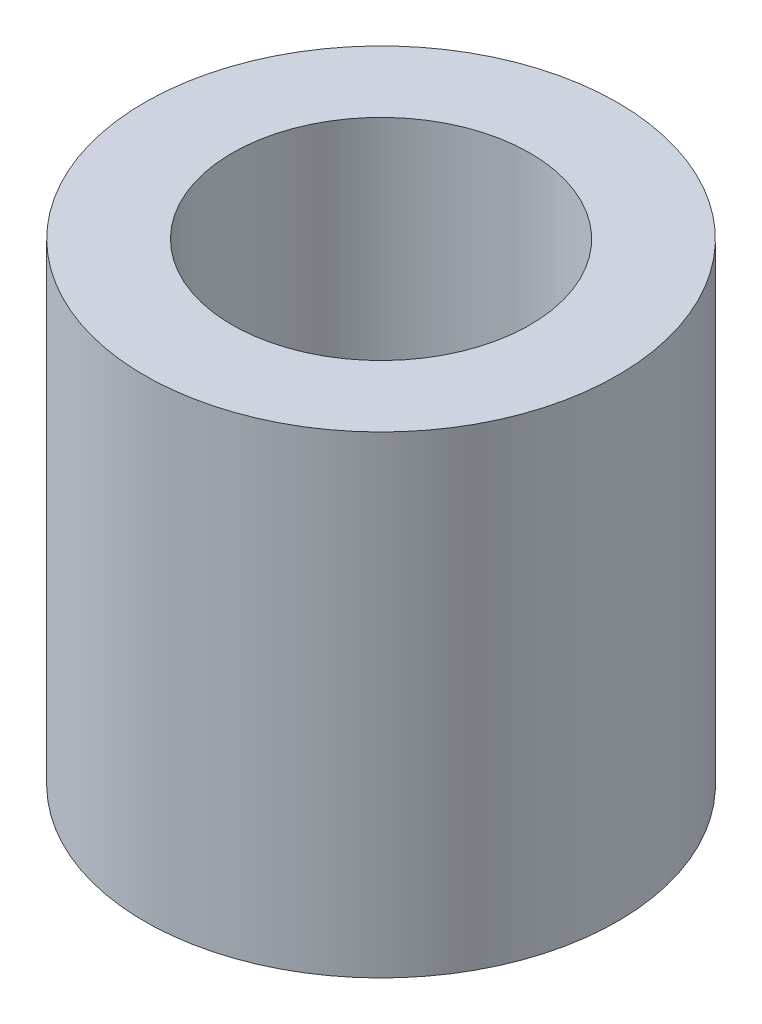
ISO-10303-21;
HEADER;
FILE_DESCRIPTION(('STEP AP214'),'2;1');
FILE_NAME('part.step','',(''),(''),'','','');
FILE_SCHEMA(('AUTOMOTIVE_DESIGN { 1 0 10303 214 1 1 1 1 }'));
ENDSEC;
DATA;
#1=APPLICATION_CONTEXT('core data for automotive mechanical design processes');
#2=APPLICATION_PROTOCOL_DEFINITION('international standard','automotive_design',2000,#1);
#3=PRODUCT_CONTEXT('',#1,'mechanical');
#4=PRODUCT('Part','Part','',(#3));
#5=PRODUCT_RELATED_PRODUCT_CATEGORY('part','',(#4));
#6=PRODUCT_DEFINITION_FORMATION('','',#4);
#7=PRODUCT_DEFINITION_CONTEXT('part definition',#1,'design');
#8=PRODUCT_DEFINITION('design','',#6,#7);
#9=PRODUCT_DEFINITION_SHAPE('','',#8);
#10=(LENGTH_UNIT() NAMED_UNIT(*) SI_UNIT(.MILLI.,.METRE.));
#11=(NAMED_UNIT(*) PLANE_ANGLE_UNIT() SI_UNIT($,.RADIAN.));
#12=(NAMED_UNIT(*) SI_UNIT($,.STERADIAN.) SOLID_ANGLE_UNIT());
#13=UNCERTAINTY_MEASURE_WITH_UNIT(LENGTH_MEASURE(1.E-05),#10,'distance_accuracy_value','');
#14=(GEOMETRIC_REPRESENTATION_CONTEXT(3) GLOBAL_UNCERTAINTY_ASSIGNED_CONTEXT((#13)) GLOBAL_UNIT_ASSIGNED_CONTEXT((#10,
#11,#12)) REPRESENTATION_CONTEXT('',''));
#15=CARTESIAN_POINT('',(0.,0.,0.));
#16=DIRECTION('',(0.,0.,1.));
#17=DIRECTION('',(1.,0.,0.));
#18=AXIS2_PLACEMENT_3D('',#15,#16,#17);
#19=CARTESIAN_POINT('',(0.,0.,0.));
#20=DIRECTION('',(0.,-1.,0.));
#21=DIRECTION('',(0.,0.,-1.));
#22=AXIS2_PLACEMENT_3D('',#19,#20,#21);
#23=CYLINDRICAL_SURFACE('',#22,2.);
#24=CARTESIAN_POINT('',(0.,6.35,0.));
#25=DIRECTION('',(0.,-1.,0.));
#26=DIRECTION('',(0.,0.,-1.));
#27=AXIS2_PLACEMENT_3D('',#24,#25,#26);
#28=CIRCLE('',#27,2.);
#29=CARTESIAN_POINT('',(0.,6.35,-2.));
#30=VERTEX_POINT('',#29);
#31=EDGE_CURVE('E10',#30,#30,#28,.T.);
#32=ORIENTED_EDGE('',*,*,#31,.F.);
#33=EDGE_LOOP('',(#32));
#34=FACE_BOUND('',#33,.T.);
#35=CARTESIAN_POINT('',(0.,0.,0.));
#36=DIRECTION('',(0.,-1.,0.));
#37=DIRECTION('',(0.,0.,-1.));
#38=AXIS2_PLACEMENT_3D('',#35,#36,#37);
#39=CIRCLE('',#38,2.);
#40=CARTESIAN_POINT('',(0.,0.,-2.));
#41=VERTEX_POINT('',#40);
#42=EDGE_CURVE('E56',#41,#41,#39,.T.);
#43=ORIENTED_EDGE('',*,*,#42,.T.);
#44=EDGE_LOOP('',(#43));
#45=FACE_BOUND('',#44,.T.);
#46=ADVANCED_FACE('F39',(#34,#45),#23,.F.);
#47=CARTESIAN_POINT('',(-2.,6.35,0.));
#48=DIRECTION('',(0.,-1.,0.));
#49=DIRECTION('',(0.,0.,-1.));
#50=AXIS2_PLACEMENT_3D('',#47,#48,#49);
#51=PLANE('',#50);
#52=CARTESIAN_POINT('',(0.,6.35,0.));
#53=DIRECTION('',(0.,-1.,0.));
#54=DIRECTION('',(0.,0.,-1.));
#55=AXIS2_PLACEMENT_3D('',#52,#53,#54);
#56=CIRCLE('',#55,3.175);
#57=CARTESIAN_POINT('',(0.,6.35,-3.175));
#58=VERTEX_POINT('',#57);
#59=EDGE_CURVE('E46',#58,#58,#56,.T.);
#60=ORIENTED_EDGE('',*,*,#59,.F.);
#61=EDGE_LOOP('',(#60));
#62=FACE_BOUND('',#61,.T.);
#63=ORIENTED_EDGE('',*,*,#31,.T.);
#64=EDGE_LOOP('',(#63));
#65=FACE_BOUND('',#64,.T.);
#66=ADVANCED_FACE('F72',(#62,#65),#51,.F.);
#67=CARTESIAN_POINT('',(0.,0.,0.));
#68=DIRECTION('',(0.,-1.,0.));
#69=DIRECTION('',(0.,0.,-1.));
#70=AXIS2_PLACEMENT_3D('',#67,#68,#69);
#71=CYLINDRICAL_SURFACE('',#70,3.175);
#72=CARTESIAN_POINT('',(0.,0.,0.));
#73=DIRECTION('',(0.,-1.,0.));
#74=DIRECTION('',(0.,0.,-1.));
#75=AXIS2_PLACEMENT_3D('',#72,#73,#74);
#76=CIRCLE('',#75,3.175);
#77=CARTESIAN_POINT('',(0.,0.,-3.175));
#78=VERTEX_POINT('',#77);
#79=EDGE_CURVE('E51',#78,#78,#76,.T.);
#80=ORIENTED_EDGE('',*,*,#79,.F.);
#81=EDGE_LOOP('',(#80));
#82=FACE_BOUND('',#81,.T.);
#83=ORIENTED_EDGE('',*,*,#59,.T.);
#84=EDGE_LOOP('',(#83));
#85=FACE_BOUND('',#84,.T.);
#86=ADVANCED_FACE('F67',(#82,#85),#71,.T.);
#87=CARTESIAN_POINT('',(-2.,0.,0.));
#88=DIRECTION('',(0.,1.,0.));
#89=DIRECTION('',(0.,0.,1.));
#90=AXIS2_PLACEMENT_3D('',#87,#88,#89);
#91=PLANE('',#90);
#92=ORIENTED_EDGE('',*,*,#42,.F.);
#93=EDGE_LOOP('',(#92));
#94=FACE_BOUND('',#93,.T.);
#95=ORIENTED_EDGE('',*,*,#79,.T.);
#96=EDGE_LOOP('',(#95));
#97=FACE_BOUND('',#96,.T.);
#98=ADVANCED_FACE('F64',(#94,#97),#91,.F.);
#99=CLOSED_SHELL('',(#46,#66,#86,#98));
#100=MANIFOLD_SOLID_BREP('B2',#99);
#101=ADVANCED_BREP_SHAPE_REPRESENTATION('',(#18,#100),#14);
#102=SHAPE_DEFINITION_REPRESENTATION(#9,#101);
ENDSEC;
END-ISO-10303-21;
